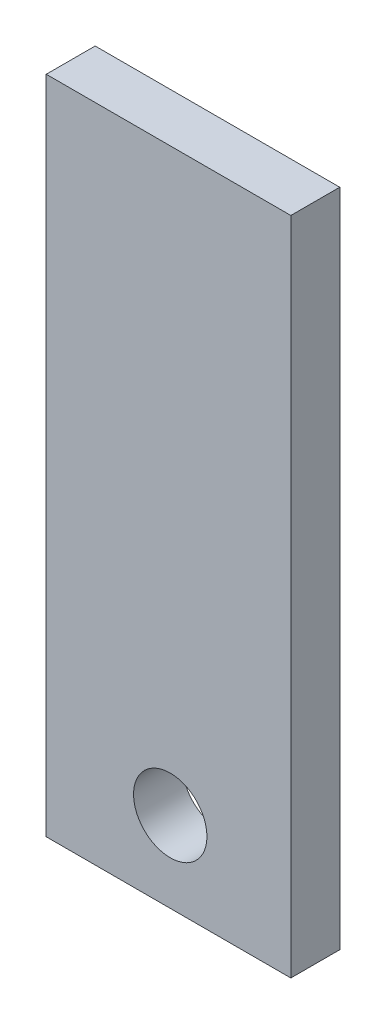
ISO-10303-21;
HEADER;
FILE_DESCRIPTION(('STEP AP214'),'2;1');
FILE_NAME('part.step','',(''),(''),'','','');
FILE_SCHEMA(('AUTOMOTIVE_DESIGN { 1 0 10303 214 1 1 1 1 }'));
ENDSEC;
DATA;
#1=APPLICATION_CONTEXT('core data for automotive mechanical design processes');
#2=APPLICATION_PROTOCOL_DEFINITION('international standard','automotive_design',2000,#1);
#3=PRODUCT_CONTEXT('',#1,'mechanical');
#4=PRODUCT('Part','Part','',(#3));
#5=PRODUCT_RELATED_PRODUCT_CATEGORY('part','',(#4));
#6=PRODUCT_DEFINITION_FORMATION('','',#4);
#7=PRODUCT_DEFINITION_CONTEXT('part definition',#1,'design');
#8=PRODUCT_DEFINITION('design','',#6,#7);
#9=PRODUCT_DEFINITION_SHAPE('','',#8);
#10=(LENGTH_UNIT() NAMED_UNIT(*) SI_UNIT(.MILLI.,.METRE.));
#11=(NAMED_UNIT(*) PLANE_ANGLE_UNIT() SI_UNIT($,.RADIAN.));
#12=(NAMED_UNIT(*) SI_UNIT($,.STERADIAN.) SOLID_ANGLE_UNIT());
#13=UNCERTAINTY_MEASURE_WITH_UNIT(LENGTH_MEASURE(1.E-05),#10,'distance_accuracy_value','');
#14=(GEOMETRIC_REPRESENTATION_CONTEXT(3) GLOBAL_UNCERTAINTY_ASSIGNED_CONTEXT((#13)) GLOBAL_UNIT_ASSIGNED_CONTEXT((#10,
#11,#12)) REPRESENTATION_CONTEXT('',''));
#15=CARTESIAN_POINT('',(0.,0.,0.));
#16=DIRECTION('',(0.,0.,1.));
#17=DIRECTION('',(1.,0.,0.));
#18=AXIS2_PLACEMENT_3D('',#15,#16,#17);
#19=CARTESIAN_POINT('',(0.,0.,14.));
#20=DIRECTION('',(0.,0.,-1.));
#21=DIRECTION('',(-1.,0.,0.));
#22=AXIS2_PLACEMENT_3D('',#19,#20,#21);
#23=PLANE('',#22);
#24=DIRECTION('',(0.,-1.,0.));
#25=VECTOR('',#24,1.);
#26=CARTESIAN_POINT('',(0.,0.,14.));
#27=LINE('',#26,#25);
#28=CARTESIAN_POINT('',(0.,189.,14.));
#29=VERTEX_POINT('',#28);
#30=CARTESIAN_POINT('',(0.,0.,14.));
#31=VERTEX_POINT('',#30);
#32=EDGE_CURVE('E92',#29,#31,#27,.T.);
#33=ORIENTED_EDGE('',*,*,#32,.T.);
#34=DIRECTION('',(1.,0.,0.));
#35=VECTOR('',#34,1.);
#36=CARTESIAN_POINT('',(0.,0.,14.));
#37=LINE('',#36,#35);
#38=CARTESIAN_POINT('',(70.,0.,14.));
#39=VERTEX_POINT('',#38);
#40=EDGE_CURVE('E87',#31,#39,#37,.T.);
#41=ORIENTED_EDGE('',*,*,#40,.T.);
#42=DIRECTION('',(0.,1.,0.));
#43=VECTOR('',#42,1.);
#44=CARTESIAN_POINT('',(70.,0.,14.));
#45=LINE('',#44,#43);
#46=CARTESIAN_POINT('',(70.,189.,14.));
#47=VERTEX_POINT('',#46);
#48=EDGE_CURVE('E90',#39,#47,#45,.T.);
#49=ORIENTED_EDGE('',*,*,#48,.T.);
#50=DIRECTION('',(-1.,0.,0.));
#51=VECTOR('',#50,1.);
#52=CARTESIAN_POINT('',(0.,189.,14.));
#53=LINE('',#52,#51);
#54=EDGE_CURVE('E57',#47,#29,#53,.T.);
#55=ORIENTED_EDGE('',*,*,#54,.T.);
#56=EDGE_LOOP('',(#33,#41,#49,#55));
#57=FACE_BOUND('',#56,.T.);
#58=CARTESIAN_POINT('',(35.49,23.0405616224649,14.));
#59=DIRECTION('',(0.,0.,1.));
#60=DIRECTION('',(1.,0.,0.));
#61=AXIS2_PLACEMENT_3D('',#58,#59,#60);
#62=CIRCLE('',#61,10.5);
#63=CARTESIAN_POINT('',(45.99,23.0405616224649,14.));
#64=VERTEX_POINT('',#63);
#65=EDGE_CURVE('E112',#64,#64,#62,.T.);
#66=ORIENTED_EDGE('',*,*,#65,.F.);
#67=EDGE_LOOP('',(#66));
#68=FACE_BOUND('',#67,.T.);
#69=ADVANCED_FACE('F39',(#57,#68),#23,.F.);
#70=CARTESIAN_POINT('',(0.,0.,0.));
#71=DIRECTION('',(0.,0.,-1.));
#72=DIRECTION('',(-1.,0.,0.));
#73=AXIS2_PLACEMENT_3D('',#70,#71,#72);
#74=PLANE('',#73);
#75=DIRECTION('',(0.,-1.,0.));
#76=VECTOR('',#75,1.);
#77=CARTESIAN_POINT('',(0.,0.,0.));
#78=LINE('',#77,#76);
#79=CARTESIAN_POINT('',(0.,189.,0.));
#80=VERTEX_POINT('',#79);
#81=CARTESIAN_POINT('',(0.,0.,0.));
#82=VERTEX_POINT('',#81);
#83=EDGE_CURVE('E108',#80,#82,#78,.T.);
#84=ORIENTED_EDGE('',*,*,#83,.F.);
#85=DIRECTION('',(-1.,0.,0.));
#86=VECTOR('',#85,1.);
#87=CARTESIAN_POINT('',(0.,189.,0.));
#88=LINE('',#87,#86);
#89=CARTESIAN_POINT('',(70.,189.,0.));
#90=VERTEX_POINT('',#89);
#91=EDGE_CURVE('E80',#90,#80,#88,.T.);
#92=ORIENTED_EDGE('',*,*,#91,.F.);
#93=DIRECTION('',(0.,1.,0.));
#94=VECTOR('',#93,1.);
#95=CARTESIAN_POINT('',(70.,0.,0.));
#96=LINE('',#95,#94);
#97=CARTESIAN_POINT('',(70.,0.,0.));
#98=VERTEX_POINT('',#97);
#99=EDGE_CURVE('E74',#98,#90,#96,.T.);
#100=ORIENTED_EDGE('',*,*,#99,.F.);
#101=DIRECTION('',(1.,0.,0.));
#102=VECTOR('',#101,1.);
#103=CARTESIAN_POINT('',(0.,0.,0.));
#104=LINE('',#103,#102);
#105=EDGE_CURVE('E97',#82,#98,#104,.T.);
#106=ORIENTED_EDGE('',*,*,#105,.F.);
#107=EDGE_LOOP('',(#84,#92,#100,#106));
#108=FACE_BOUND('',#107,.T.);
#109=CARTESIAN_POINT('',(35.49,23.0405616224649,0.));
#110=DIRECTION('',(0.,0.,1.));
#111=DIRECTION('',(1.,0.,0.));
#112=AXIS2_PLACEMENT_3D('',#109,#110,#111);
#113=CIRCLE('',#112,10.5);
#114=CARTESIAN_POINT('',(45.99,23.0405616224649,0.));
#115=VERTEX_POINT('',#114);
#116=EDGE_CURVE('E130',#115,#115,#113,.T.);
#117=ORIENTED_EDGE('',*,*,#116,.T.);
#118=EDGE_LOOP('',(#117));
#119=FACE_BOUND('',#118,.T.);
#120=ADVANCED_FACE('F125',(#108,#119),#74,.T.);
#121=CARTESIAN_POINT('',(0.,0.,14.));
#122=DIRECTION('',(1.,0.,0.));
#123=DIRECTION('',(0.,0.,-1.));
#124=AXIS2_PLACEMENT_3D('',#121,#122,#123);
#125=PLANE('',#124);
#126=ORIENTED_EDGE('',*,*,#83,.T.);
#127=DIRECTION('',(0.,0.,-1.));
#128=VECTOR('',#127,1.);
#129=CARTESIAN_POINT('',(0.,0.,14.));
#130=LINE('',#129,#128);
#131=EDGE_CURVE('E11',#31,#82,#130,.T.);
#132=ORIENTED_EDGE('',*,*,#131,.F.);
#133=ORIENTED_EDGE('',*,*,#32,.F.);
#134=DIRECTION('',(0.,0.,-1.));
#135=VECTOR('',#134,1.);
#136=CARTESIAN_POINT('',(0.,189.,14.));
#137=LINE('',#136,#135);
#138=EDGE_CURVE('E104',#29,#80,#137,.T.);
#139=ORIENTED_EDGE('',*,*,#138,.T.);
#140=EDGE_LOOP('',(#126,#132,#133,#139));
#141=FACE_BOUND('',#140,.T.);
#142=ADVANCED_FACE('F41',(#141),#125,.F.);
#143=CARTESIAN_POINT('',(0.,0.,14.));
#144=DIRECTION('',(0.,1.,0.));
#145=DIRECTION('',(0.,0.,1.));
#146=AXIS2_PLACEMENT_3D('',#143,#144,#145);
#147=PLANE('',#146);
#148=ORIENTED_EDGE('',*,*,#105,.T.);
#149=DIRECTION('',(0.,0.,-1.));
#150=VECTOR('',#149,1.);
#151=CARTESIAN_POINT('',(70.,0.,14.));
#152=LINE('',#151,#150);
#153=EDGE_CURVE('E49',#39,#98,#152,.T.);
#154=ORIENTED_EDGE('',*,*,#153,.F.);
#155=ORIENTED_EDGE('',*,*,#40,.F.);
#156=ORIENTED_EDGE('',*,*,#131,.T.);
#157=EDGE_LOOP('',(#148,#154,#155,#156));
#158=FACE_BOUND('',#157,.T.);
#159=ADVANCED_FACE('F96',(#158),#147,.F.);
#160=CARTESIAN_POINT('',(70.,0.,14.));
#161=DIRECTION('',(-1.,0.,0.));
#162=DIRECTION('',(0.,0.,1.));
#163=AXIS2_PLACEMENT_3D('',#160,#161,#162);
#164=PLANE('',#163);
#165=ORIENTED_EDGE('',*,*,#99,.T.);
#166=DIRECTION('',(0.,0.,-1.));
#167=VECTOR('',#166,1.);
#168=CARTESIAN_POINT('',(70.,189.,14.));
#169=LINE('',#168,#167);
#170=EDGE_CURVE('E99',#47,#90,#169,.T.);
#171=ORIENTED_EDGE('',*,*,#170,.F.);
#172=ORIENTED_EDGE('',*,*,#48,.F.);
#173=ORIENTED_EDGE('',*,*,#153,.T.);
#174=EDGE_LOOP('',(#165,#171,#172,#173));
#175=FACE_BOUND('',#174,.T.);
#176=ADVANCED_FACE('F100',(#175),#164,.F.);
#177=CARTESIAN_POINT('',(0.,189.,14.));
#178=DIRECTION('',(0.,-1.,0.));
#179=DIRECTION('',(0.,0.,-1.));
#180=AXIS2_PLACEMENT_3D('',#177,#178,#179);
#181=PLANE('',#180);
#182=ORIENTED_EDGE('',*,*,#91,.T.);
#183=ORIENTED_EDGE('',*,*,#138,.F.);
#184=ORIENTED_EDGE('',*,*,#54,.F.);
#185=ORIENTED_EDGE('',*,*,#170,.T.);
#186=EDGE_LOOP('',(#182,#183,#184,#185));
#187=FACE_BOUND('',#186,.T.);
#188=ADVANCED_FACE('F122',(#187),#181,.F.);
#189=CARTESIAN_POINT('',(35.49,23.0405616224649,14.));
#190=DIRECTION('',(0.,0.,-1.));
#191=DIRECTION('',(-1.,0.,0.));
#192=AXIS2_PLACEMENT_3D('',#189,#190,#191);
#193=CYLINDRICAL_SURFACE('',#192,10.5);
#194=ORIENTED_EDGE('',*,*,#65,.T.);
#195=EDGE_LOOP('',(#194));
#196=FACE_BOUND('',#195,.T.);
#197=ORIENTED_EDGE('',*,*,#116,.F.);
#198=EDGE_LOOP('',(#197));
#199=FACE_BOUND('',#198,.T.);
#200=ADVANCED_FACE('F138',(#196,#199),#193,.F.);
#201=CLOSED_SHELL('',(#69,#120,#142,#159,#176,#188,#200));
#202=MANIFOLD_SOLID_BREP('B2',#201);
#203=ADVANCED_BREP_SHAPE_REPRESENTATION('',(#18,#202),#14);
#204=SHAPE_DEFINITION_REPRESENTATION(#9,#203);
ENDSEC;
END-ISO-10303-21;
